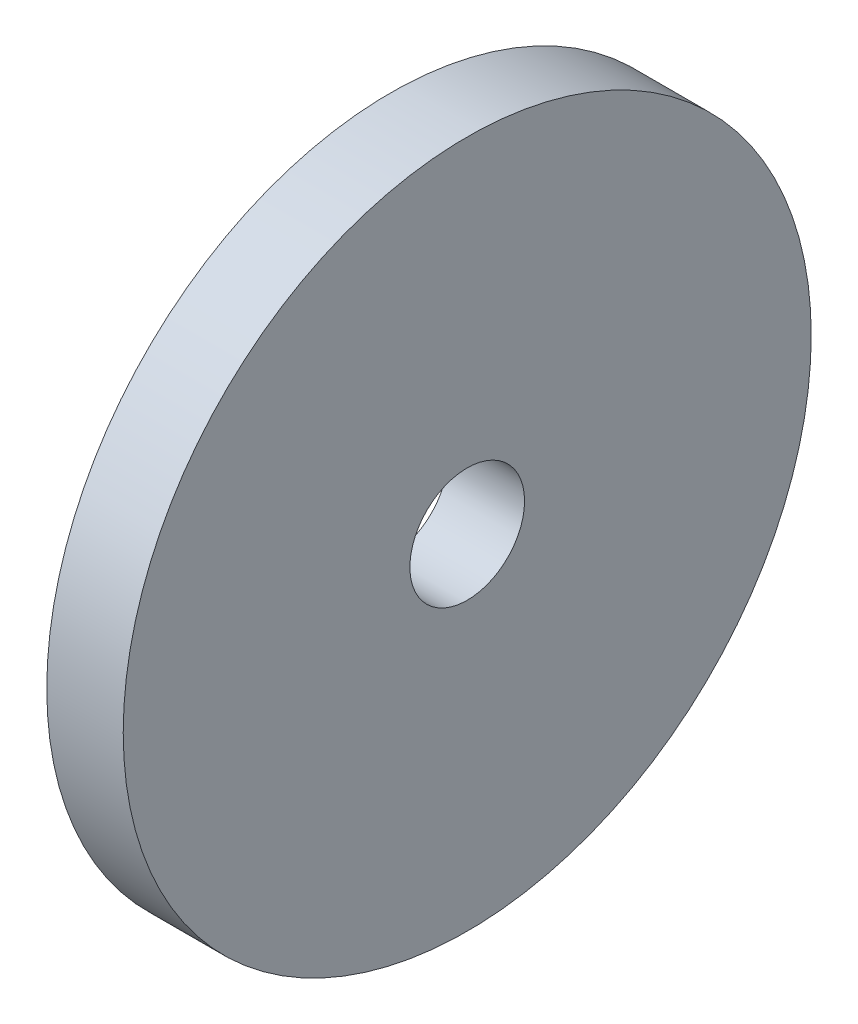
ISO-10303-21;
HEADER;
FILE_DESCRIPTION(('STEP AP214'),'2;1');
FILE_NAME('part.step','',(''),(''),'','','');
FILE_SCHEMA(('AUTOMOTIVE_DESIGN { 1 0 10303 214 1 1 1 1 }'));
ENDSEC;
DATA;
#1=APPLICATION_CONTEXT('core data for automotive mechanical design processes');
#2=APPLICATION_PROTOCOL_DEFINITION('international standard','automotive_design',2000,#1);
#3=PRODUCT_CONTEXT('',#1,'mechanical');
#4=PRODUCT('Part','Part','',(#3));
#5=PRODUCT_RELATED_PRODUCT_CATEGORY('part','',(#4));
#6=PRODUCT_DEFINITION_FORMATION('','',#4);
#7=PRODUCT_DEFINITION_CONTEXT('part definition',#1,'design');
#8=PRODUCT_DEFINITION('design','',#6,#7);
#9=PRODUCT_DEFINITION_SHAPE('','',#8);
#10=(LENGTH_UNIT() NAMED_UNIT(*) SI_UNIT(.MILLI.,.METRE.));
#11=(NAMED_UNIT(*) PLANE_ANGLE_UNIT() SI_UNIT($,.RADIAN.));
#12=(NAMED_UNIT(*) SI_UNIT($,.STERADIAN.) SOLID_ANGLE_UNIT());
#13=UNCERTAINTY_MEASURE_WITH_UNIT(LENGTH_MEASURE(1.E-05),#10,'distance_accuracy_value','');
#14=(GEOMETRIC_REPRESENTATION_CONTEXT(3) GLOBAL_UNCERTAINTY_ASSIGNED_CONTEXT((#13)) GLOBAL_UNIT_ASSIGNED_CONTEXT((#10,
#11,#12)) REPRESENTATION_CONTEXT('',''));
#15=CARTESIAN_POINT('',(0.,0.,0.));
#16=DIRECTION('',(0.,0.,1.));
#17=DIRECTION('',(1.,0.,0.));
#18=AXIS2_PLACEMENT_3D('',#15,#16,#17);
#19=CARTESIAN_POINT('',(2.,0.,0.));
#20=DIRECTION('',(-1.,0.,0.));
#21=DIRECTION('',(0.,0.,1.));
#22=AXIS2_PLACEMENT_3D('',#19,#20,#21);
#23=CYLINDRICAL_SURFACE('',#22,9.);
#24=CARTESIAN_POINT('',(2.,0.,0.));
#25=DIRECTION('',(1.,0.,0.));
#26=DIRECTION('',(0.,0.,-1.));
#27=AXIS2_PLACEMENT_3D('',#24,#25,#26);
#28=CIRCLE('',#27,9.);
#29=CARTESIAN_POINT('',(2.,0.,-9.));
#30=VERTEX_POINT('',#29);
#31=EDGE_CURVE('E10',#30,#30,#28,.T.);
#32=ORIENTED_EDGE('',*,*,#31,.F.);
#33=EDGE_LOOP('',(#32));
#34=FACE_BOUND('',#33,.T.);
#35=CARTESIAN_POINT('',(0.,0.,0.));
#36=DIRECTION('',(1.,0.,0.));
#37=DIRECTION('',(0.,0.,-1.));
#38=AXIS2_PLACEMENT_3D('',#35,#36,#37);
#39=CIRCLE('',#38,9.);
#40=CARTESIAN_POINT('',(0.,0.,-9.));
#41=VERTEX_POINT('',#40);
#42=EDGE_CURVE('E34',#41,#41,#39,.T.);
#43=ORIENTED_EDGE('',*,*,#42,.T.);
#44=EDGE_LOOP('',(#43));
#45=FACE_BOUND('',#44,.T.);
#46=ADVANCED_FACE('F31',(#34,#45),#23,.T.);
#47=CARTESIAN_POINT('',(2.,0.,0.));
#48=DIRECTION('',(1.,0.,0.));
#49=DIRECTION('',(0.,0.,-1.));
#50=AXIS2_PLACEMENT_3D('',#47,#48,#49);
#51=PLANE('',#50);
#52=CARTESIAN_POINT('',(2.,0.,0.));
#53=DIRECTION('',(1.,0.,0.));
#54=DIRECTION('',(0.,0.,-1.));
#55=AXIS2_PLACEMENT_3D('',#52,#53,#54);
#56=CIRCLE('',#55,1.5);
#57=CARTESIAN_POINT('',(2.,0.,-1.5));
#58=VERTEX_POINT('',#57);
#59=EDGE_CURVE('E43',#58,#58,#56,.T.);
#60=ORIENTED_EDGE('',*,*,#59,.F.);
#61=EDGE_LOOP('',(#60));
#62=FACE_BOUND('',#61,.T.);
#63=ORIENTED_EDGE('',*,*,#31,.T.);
#64=EDGE_LOOP('',(#63));
#65=FACE_BOUND('',#64,.T.);
#66=ADVANCED_FACE('F58',(#62,#65),#51,.T.);
#67=CARTESIAN_POINT('',(0.,0.,0.));
#68=DIRECTION('',(1.,0.,0.));
#69=DIRECTION('',(0.,0.,-1.));
#70=AXIS2_PLACEMENT_3D('',#67,#68,#69);
#71=PLANE('',#70);
#72=CARTESIAN_POINT('',(0.,0.,0.));
#73=DIRECTION('',(1.,0.,0.));
#74=DIRECTION('',(0.,0.,-1.));
#75=AXIS2_PLACEMENT_3D('',#72,#73,#74);
#76=CIRCLE('',#75,1.5);
#77=CARTESIAN_POINT('',(0.,0.,-1.5));
#78=VERTEX_POINT('',#77);
#79=EDGE_CURVE('E41',#78,#78,#76,.T.);
#80=ORIENTED_EDGE('',*,*,#79,.T.);
#81=EDGE_LOOP('',(#80));
#82=FACE_BOUND('',#81,.T.);
#83=ORIENTED_EDGE('',*,*,#42,.F.);
#84=EDGE_LOOP('',(#83));
#85=FACE_BOUND('',#84,.T.);
#86=ADVANCED_FACE('F49',(#82,#85),#71,.F.);
#87=CARTESIAN_POINT('',(0.,0.,0.));
#88=DIRECTION('',(1.,0.,0.));
#89=DIRECTION('',(0.,0.,-1.));
#90=AXIS2_PLACEMENT_3D('',#87,#88,#89);
#91=CYLINDRICAL_SURFACE('',#90,1.5);
#92=ORIENTED_EDGE('',*,*,#79,.F.);
#93=EDGE_LOOP('',(#92));
#94=FACE_BOUND('',#93,.T.);
#95=ORIENTED_EDGE('',*,*,#59,.T.);
#96=EDGE_LOOP('',(#95));
#97=FACE_BOUND('',#96,.T.);
#98=ADVANCED_FACE('F52',(#94,#97),#91,.F.);
#99=CLOSED_SHELL('',(#46,#66,#86,#98));
#100=MANIFOLD_SOLID_BREP('B2',#99);
#101=ADVANCED_BREP_SHAPE_REPRESENTATION('',(#18,#100),#14);
#102=SHAPE_DEFINITION_REPRESENTATION(#9,#101);
ENDSEC;
END-ISO-10303-21;
